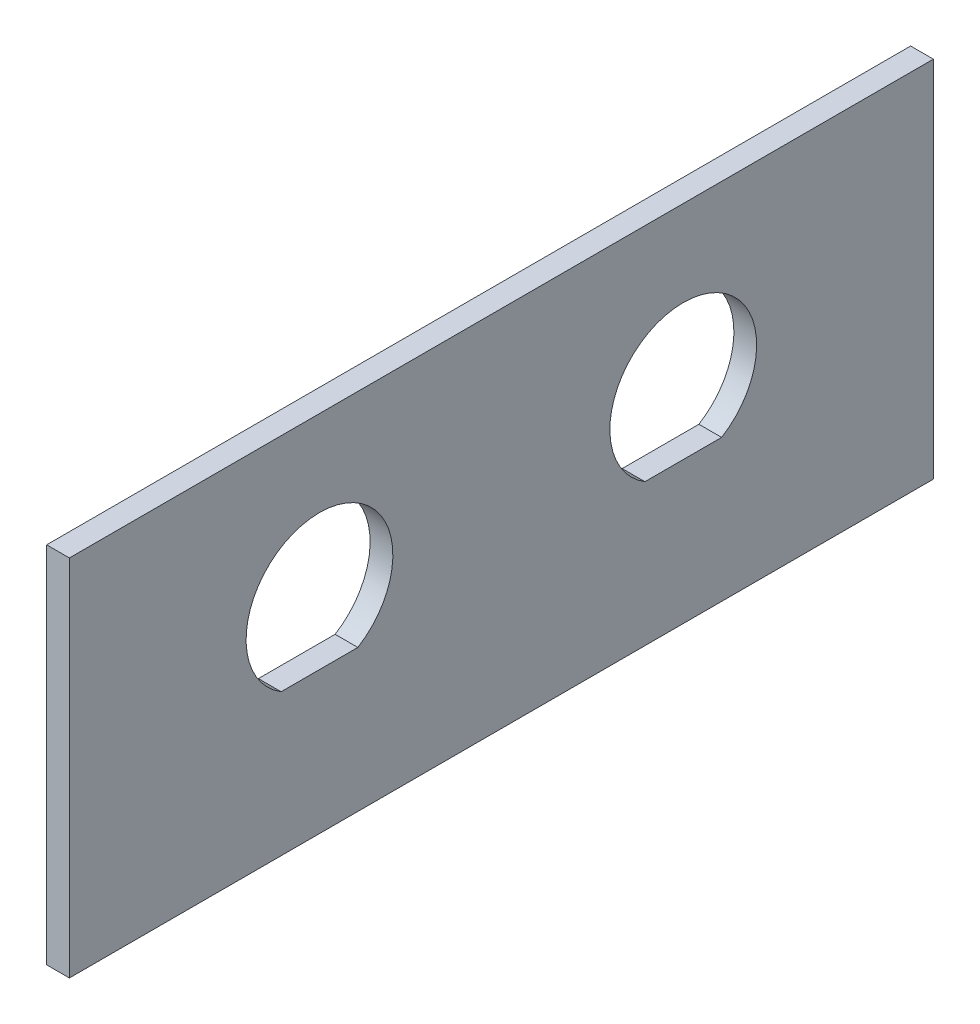
ISO-10303-21;
HEADER;
FILE_DESCRIPTION(('STEP AP214'),'2;1');
FILE_NAME('part.step','',(''),(''),'','','');
FILE_SCHEMA(('AUTOMOTIVE_DESIGN { 1 0 10303 214 1 1 1 1 }'));
ENDSEC;
DATA;
#1=APPLICATION_CONTEXT('core data for automotive mechanical design processes');
#2=APPLICATION_PROTOCOL_DEFINITION('international standard','automotive_design',2000,#1);
#3=PRODUCT_CONTEXT('',#1,'mechanical');
#4=PRODUCT('Part','Part','',(#3));
#5=PRODUCT_RELATED_PRODUCT_CATEGORY('part','',(#4));
#6=PRODUCT_DEFINITION_FORMATION('','',#4);
#7=PRODUCT_DEFINITION_CONTEXT('part definition',#1,'design');
#8=PRODUCT_DEFINITION('design','',#6,#7);
#9=PRODUCT_DEFINITION_SHAPE('','',#8);
#10=(LENGTH_UNIT() NAMED_UNIT(*) SI_UNIT(.MILLI.,.METRE.));
#11=(NAMED_UNIT(*) PLANE_ANGLE_UNIT() SI_UNIT($,.RADIAN.));
#12=(NAMED_UNIT(*) SI_UNIT($,.STERADIAN.) SOLID_ANGLE_UNIT());
#13=UNCERTAINTY_MEASURE_WITH_UNIT(LENGTH_MEASURE(1.E-05),#10,'distance_accuracy_value','');
#14=(GEOMETRIC_REPRESENTATION_CONTEXT(3) GLOBAL_UNCERTAINTY_ASSIGNED_CONTEXT((#13)) GLOBAL_UNIT_ASSIGNED_CONTEXT((#10,
#11,#12)) REPRESENTATION_CONTEXT('',''));
#15=CARTESIAN_POINT('',(0.,0.,0.));
#16=DIRECTION('',(0.,0.,1.));
#17=DIRECTION('',(1.,0.,0.));
#18=AXIS2_PLACEMENT_3D('',#15,#16,#17);
#19=CARTESIAN_POINT('',(101.6,50.8,60.325));
#20=DIRECTION('',(0.,0.,-1.));
#21=DIRECTION('',(-1.,0.,0.));
#22=AXIS2_PLACEMENT_3D('',#19,#20,#21);
#23=PLANE('',#22);
#24=DIRECTION('',(1.,0.,0.));
#25=VECTOR('',#24,1.);
#26=CARTESIAN_POINT('',(101.6,50.8,60.325));
#27=LINE('',#26,#25);
#28=CARTESIAN_POINT('',(98.425,50.8,60.325));
#29=VERTEX_POINT('',#28);
#30=CARTESIAN_POINT('',(101.6,50.8,60.325));
#31=VERTEX_POINT('',#30);
#32=EDGE_CURVE('E120',#29,#31,#27,.T.);
#33=ORIENTED_EDGE('',*,*,#32,.F.);
#34=DIRECTION('',(0.,1.,0.));
#35=VECTOR('',#34,1.);
#36=CARTESIAN_POINT('',(98.425,0.,60.325));
#37=LINE('',#36,#35);
#38=CARTESIAN_POINT('',(98.425,0.,60.325));
#39=VERTEX_POINT('',#38);
#40=EDGE_CURVE('E115',#39,#29,#37,.T.);
#41=ORIENTED_EDGE('',*,*,#40,.F.);
#42=DIRECTION('',(1.,0.,0.));
#43=VECTOR('',#42,1.);
#44=CARTESIAN_POINT('',(101.6,0.,60.325));
#45=LINE('',#44,#43);
#46=CARTESIAN_POINT('',(101.6,0.,60.325));
#47=VERTEX_POINT('',#46);
#48=EDGE_CURVE('E103',#39,#47,#45,.T.);
#49=ORIENTED_EDGE('',*,*,#48,.T.);
#50=DIRECTION('',(0.,-1.,0.));
#51=VECTOR('',#50,1.);
#52=CARTESIAN_POINT('',(101.6,50.8,60.325));
#53=LINE('',#52,#51);
#54=EDGE_CURVE('E11',#31,#47,#53,.T.);
#55=ORIENTED_EDGE('',*,*,#54,.F.);
#56=EDGE_LOOP('',(#33,#41,#49,#55));
#57=FACE_BOUND('',#56,.T.);
#58=ADVANCED_FACE('F34',(#57),#23,.F.);
#59=CARTESIAN_POINT('',(101.6,50.8,60.325));
#60=DIRECTION('',(-1.,0.,0.));
#61=DIRECTION('',(0.,0.,1.));
#62=AXIS2_PLACEMENT_3D('',#59,#60,#61);
#63=PLANE('',#62);
#64=DIRECTION('',(0.,0.,-1.));
#65=VECTOR('',#64,1.);
#66=CARTESIAN_POINT('',(101.6,19.8374,0.));
#67=LINE('',#66,#65);
#68=CARTESIAN_POINT('',(101.6,19.8374,-20.0432941605871));
#69=VERTEX_POINT('',#68);
#70=CARTESIAN_POINT('',(101.6,19.8374,-30.7567058394129));
#71=VERTEX_POINT('',#70);
#72=EDGE_CURVE('E144',#69,#71,#67,.T.);
#73=ORIENTED_EDGE('',*,*,#72,.F.);
#74=CARTESIAN_POINT('',(101.6,28.575,-25.4));
#75=DIRECTION('',(1.,0.,0.));
#76=DIRECTION('',(0.,0.,-1.));
#77=AXIS2_PLACEMENT_3D('',#74,#75,#76);
#78=CIRCLE('',#77,10.2489);
#79=EDGE_CURVE('E48',#71,#69,#78,.T.);
#80=ORIENTED_EDGE('',*,*,#79,.F.);
#81=EDGE_LOOP('',(#73,#80));
#82=FACE_BOUND('',#81,.T.);
#83=DIRECTION('',(0.,0.,-1.));
#84=VECTOR('',#83,1.);
#85=CARTESIAN_POINT('',(101.6,19.8374,0.));
#86=LINE('',#85,#84);
#87=CARTESIAN_POINT('',(101.6,19.8374,30.7567058394129));
#88=VERTEX_POINT('',#87);
#89=CARTESIAN_POINT('',(101.6,19.8374,20.0432941605871));
#90=VERTEX_POINT('',#89);
#91=EDGE_CURVE('E158',#88,#90,#86,.T.);
#92=ORIENTED_EDGE('',*,*,#91,.F.);
#93=CARTESIAN_POINT('',(101.6,28.575,25.4));
#94=DIRECTION('',(1.,0.,0.));
#95=DIRECTION('',(0.,0.,-1.));
#96=AXIS2_PLACEMENT_3D('',#93,#94,#95);
#97=CIRCLE('',#96,10.2489);
#98=EDGE_CURVE('E156',#90,#88,#97,.T.);
#99=ORIENTED_EDGE('',*,*,#98,.F.);
#100=EDGE_LOOP('',(#92,#99));
#101=FACE_BOUND('',#100,.T.);
#102=ORIENTED_EDGE('',*,*,#54,.T.);
#103=DIRECTION('',(0.,0.,-1.));
#104=VECTOR('',#103,1.);
#105=CARTESIAN_POINT('',(101.6,0.,60.325));
#106=LINE('',#105,#104);
#107=CARTESIAN_POINT('',(101.6,0.,-60.325));
#108=VERTEX_POINT('',#107);
#109=EDGE_CURVE('E121',#47,#108,#106,.T.);
#110=ORIENTED_EDGE('',*,*,#109,.T.);
#111=DIRECTION('',(0.,-1.,0.));
#112=VECTOR('',#111,1.);
#113=CARTESIAN_POINT('',(101.6,50.8,-60.325));
#114=LINE('',#113,#112);
#115=CARTESIAN_POINT('',(101.6,50.8,-60.325));
#116=VERTEX_POINT('',#115);
#117=EDGE_CURVE('E41',#116,#108,#114,.T.);
#118=ORIENTED_EDGE('',*,*,#117,.F.);
#119=DIRECTION('',(0.,0.,-1.));
#120=VECTOR('',#119,1.);
#121=CARTESIAN_POINT('',(101.6,50.8,60.325));
#122=LINE('',#121,#120);
#123=EDGE_CURVE('E123',#31,#116,#122,.T.);
#124=ORIENTED_EDGE('',*,*,#123,.F.);
#125=EDGE_LOOP('',(#102,#110,#118,#124));
#126=FACE_BOUND('',#125,.T.);
#127=ADVANCED_FACE('F136',(#82,#101,#126),#63,.F.);
#128=CARTESIAN_POINT('',(101.6,50.8,-60.325));
#129=DIRECTION('',(0.,0.,1.));
#130=DIRECTION('',(1.,0.,0.));
#131=AXIS2_PLACEMENT_3D('',#128,#129,#130);
#132=PLANE('',#131);
#133=DIRECTION('',(-1.,0.,0.));
#134=VECTOR('',#133,1.);
#135=CARTESIAN_POINT('',(101.6,0.,-60.325));
#136=LINE('',#135,#134);
#137=CARTESIAN_POINT('',(98.425,0.,-60.325));
#138=VERTEX_POINT('',#137);
#139=EDGE_CURVE('E102',#108,#138,#136,.T.);
#140=ORIENTED_EDGE('',*,*,#139,.T.);
#141=DIRECTION('',(0.,1.,0.));
#142=VECTOR('',#141,1.);
#143=CARTESIAN_POINT('',(98.425,0.,-60.325));
#144=LINE('',#143,#142);
#145=CARTESIAN_POINT('',(98.425,50.8,-60.325));
#146=VERTEX_POINT('',#145);
#147=EDGE_CURVE('E110',#138,#146,#144,.T.);
#148=ORIENTED_EDGE('',*,*,#147,.T.);
#149=DIRECTION('',(-1.,0.,0.));
#150=VECTOR('',#149,1.);
#151=CARTESIAN_POINT('',(101.6,50.8,-60.325));
#152=LINE('',#151,#150);
#153=EDGE_CURVE('E127',#116,#146,#152,.T.);
#154=ORIENTED_EDGE('',*,*,#153,.F.);
#155=ORIENTED_EDGE('',*,*,#117,.T.);
#156=EDGE_LOOP('',(#140,#148,#154,#155));
#157=FACE_BOUND('',#156,.T.);
#158=ADVANCED_FACE('F117',(#157),#132,.F.);
#159=CARTESIAN_POINT('',(0.,50.8,0.));
#160=DIRECTION('',(0.,1.,0.));
#161=DIRECTION('',(0.,0.,1.));
#162=AXIS2_PLACEMENT_3D('',#159,#160,#161);
#163=PLANE('',#162);
#164=DIRECTION('',(0.,0.,-1.));
#165=VECTOR('',#164,1.);
#166=CARTESIAN_POINT('',(98.425,50.8,57.15));
#167=LINE('',#166,#165);
#168=EDGE_CURVE('E107',#29,#146,#167,.T.);
#169=ORIENTED_EDGE('',*,*,#168,.F.);
#170=ORIENTED_EDGE('',*,*,#32,.T.);
#171=ORIENTED_EDGE('',*,*,#123,.T.);
#172=ORIENTED_EDGE('',*,*,#153,.T.);
#173=EDGE_LOOP('',(#169,#170,#171,#172));
#174=FACE_BOUND('',#173,.T.);
#175=ADVANCED_FACE('F137',(#174),#163,.T.);
#176=CARTESIAN_POINT('',(0.,0.,0.));
#177=DIRECTION('',(0.,1.,0.));
#178=DIRECTION('',(0.,0.,1.));
#179=AXIS2_PLACEMENT_3D('',#176,#177,#178);
#180=PLANE('',#179);
#181=ORIENTED_EDGE('',*,*,#48,.F.);
#182=DIRECTION('',(0.,0.,-1.));
#183=VECTOR('',#182,1.);
#184=CARTESIAN_POINT('',(98.425,0.,57.15));
#185=LINE('',#184,#183);
#186=EDGE_CURVE('E97',#39,#138,#185,.T.);
#187=ORIENTED_EDGE('',*,*,#186,.T.);
#188=ORIENTED_EDGE('',*,*,#139,.F.);
#189=ORIENTED_EDGE('',*,*,#109,.F.);
#190=EDGE_LOOP('',(#181,#187,#188,#189));
#191=FACE_BOUND('',#190,.T.);
#192=ADVANCED_FACE('F99',(#191),#180,.F.);
#193=CARTESIAN_POINT('',(98.425,0.,57.15));
#194=DIRECTION('',(1.,0.,0.));
#195=DIRECTION('',(0.,0.,-1.));
#196=AXIS2_PLACEMENT_3D('',#193,#194,#195);
#197=PLANE('',#196);
#198=DIRECTION('',(0.,0.,1.));
#199=VECTOR('',#198,1.);
#200=CARTESIAN_POINT('',(98.425,19.8374,0.));
#201=LINE('',#200,#199);
#202=CARTESIAN_POINT('',(98.425,19.8374,-30.7567058394129));
#203=VERTEX_POINT('',#202);
#204=CARTESIAN_POINT('',(98.425,19.8374,-20.0432941605871));
#205=VERTEX_POINT('',#204);
#206=EDGE_CURVE('E150',#203,#205,#201,.T.);
#207=ORIENTED_EDGE('',*,*,#206,.F.);
#208=CARTESIAN_POINT('',(98.425,28.575,-25.4));
#209=DIRECTION('',(1.,0.,0.));
#210=DIRECTION('',(0.,0.,-1.));
#211=AXIS2_PLACEMENT_3D('',#208,#209,#210);
#212=CIRCLE('',#211,10.2489);
#213=EDGE_CURVE('E53',#205,#203,#212,.F.);
#214=ORIENTED_EDGE('',*,*,#213,.F.);
#215=EDGE_LOOP('',(#207,#214));
#216=FACE_BOUND('',#215,.T.);
#217=DIRECTION('',(0.,0.,1.));
#218=VECTOR('',#217,1.);
#219=CARTESIAN_POINT('',(98.425,19.8374,0.));
#220=LINE('',#219,#218);
#221=CARTESIAN_POINT('',(98.425,19.8374,20.0432941605871));
#222=VERTEX_POINT('',#221);
#223=CARTESIAN_POINT('',(98.425,19.8374,30.7567058394129));
#224=VERTEX_POINT('',#223);
#225=EDGE_CURVE('E138',#222,#224,#220,.T.);
#226=ORIENTED_EDGE('',*,*,#225,.F.);
#227=CARTESIAN_POINT('',(98.425,28.575,25.4));
#228=DIRECTION('',(1.,0.,0.));
#229=DIRECTION('',(0.,0.,-1.));
#230=AXIS2_PLACEMENT_3D('',#227,#228,#229);
#231=CIRCLE('',#230,10.2489);
#232=EDGE_CURVE('E154',#224,#222,#231,.F.);
#233=ORIENTED_EDGE('',*,*,#232,.F.);
#234=EDGE_LOOP('',(#226,#233));
#235=FACE_BOUND('',#234,.T.);
#236=ORIENTED_EDGE('',*,*,#168,.T.);
#237=ORIENTED_EDGE('',*,*,#147,.F.);
#238=ORIENTED_EDGE('',*,*,#186,.F.);
#239=ORIENTED_EDGE('',*,*,#40,.T.);
#240=EDGE_LOOP('',(#236,#237,#238,#239));
#241=FACE_BOUND('',#240,.T.);
#242=ADVANCED_FACE('F111',(#216,#235,#241),#197,.F.);
#243=CARTESIAN_POINT('',(-101.601,28.575,25.4));
#244=DIRECTION('',(1.,0.,0.));
#245=DIRECTION('',(0.,0.,-1.));
#246=AXIS2_PLACEMENT_3D('',#243,#244,#245);
#247=CYLINDRICAL_SURFACE('',#246,10.2489);
#248=ORIENTED_EDGE('',*,*,#232,.T.);
#249=DIRECTION('',(1.,0.,0.));
#250=VECTOR('',#249,1.);
#251=CARTESIAN_POINT('',(-101.601,19.8374,20.0432941605871));
#252=LINE('',#251,#250);
#253=EDGE_CURVE('E162',#222,#90,#252,.T.);
#254=ORIENTED_EDGE('',*,*,#253,.T.);
#255=ORIENTED_EDGE('',*,*,#98,.T.);
#256=DIRECTION('',(1.,0.,0.));
#257=VECTOR('',#256,1.);
#258=CARTESIAN_POINT('',(-101.601,19.8374,30.7567058394129));
#259=LINE('',#258,#257);
#260=EDGE_CURVE('E161',#224,#88,#259,.T.);
#261=ORIENTED_EDGE('',*,*,#260,.F.);
#262=EDGE_LOOP('',(#248,#254,#255,#261));
#263=FACE_BOUND('',#262,.T.);
#264=ADVANCED_FACE('F175',(#263),#247,.F.);
#265=CARTESIAN_POINT('',(-101.601,19.8374,0.));
#266=DIRECTION('',(0.,-1.,0.));
#267=DIRECTION('',(0.,0.,-1.));
#268=AXIS2_PLACEMENT_3D('',#265,#266,#267);
#269=PLANE('',#268);
#270=ORIENTED_EDGE('',*,*,#225,.T.);
#271=ORIENTED_EDGE('',*,*,#260,.T.);
#272=ORIENTED_EDGE('',*,*,#91,.T.);
#273=ORIENTED_EDGE('',*,*,#253,.F.);
#274=EDGE_LOOP('',(#270,#271,#272,#273));
#275=FACE_BOUND('',#274,.T.);
#276=ADVANCED_FACE('F171',(#275),#269,.F.);
#277=CARTESIAN_POINT('',(-101.601,28.575,-25.4));
#278=DIRECTION('',(1.,0.,0.));
#279=DIRECTION('',(0.,0.,-1.));
#280=AXIS2_PLACEMENT_3D('',#277,#278,#279);
#281=CYLINDRICAL_SURFACE('',#280,10.2489);
#282=ORIENTED_EDGE('',*,*,#213,.T.);
#283=DIRECTION('',(1.,0.,0.));
#284=VECTOR('',#283,1.);
#285=CARTESIAN_POINT('',(-101.601,19.8374,-30.7567058394129));
#286=LINE('',#285,#284);
#287=EDGE_CURVE('E148',#203,#71,#286,.T.);
#288=ORIENTED_EDGE('',*,*,#287,.T.);
#289=ORIENTED_EDGE('',*,*,#79,.T.);
#290=DIRECTION('',(1.,0.,0.));
#291=VECTOR('',#290,1.);
#292=CARTESIAN_POINT('',(-101.601,19.8374,-20.0432941605871));
#293=LINE('',#292,#291);
#294=EDGE_CURVE('E147',#205,#69,#293,.T.);
#295=ORIENTED_EDGE('',*,*,#294,.F.);
#296=EDGE_LOOP('',(#282,#288,#289,#295));
#297=FACE_BOUND('',#296,.T.);
#298=ADVANCED_FACE('F198',(#297),#281,.F.);
#299=CARTESIAN_POINT('',(-101.601,19.8374,0.));
#300=DIRECTION('',(0.,-1.,0.));
#301=DIRECTION('',(0.,0.,-1.));
#302=AXIS2_PLACEMENT_3D('',#299,#300,#301);
#303=PLANE('',#302);
#304=ORIENTED_EDGE('',*,*,#206,.T.);
#305=ORIENTED_EDGE('',*,*,#294,.T.);
#306=ORIENTED_EDGE('',*,*,#72,.T.);
#307=ORIENTED_EDGE('',*,*,#287,.F.);
#308=EDGE_LOOP('',(#304,#305,#306,#307));
#309=FACE_BOUND('',#308,.T.);
#310=ADVANCED_FACE('F201',(#309),#303,.F.);
#311=CLOSED_SHELL('',(#58,#127,#158,#175,#192,#242,#264,#276,#298,#310));
#312=MANIFOLD_SOLID_BREP('B2',#311);
#313=ADVANCED_BREP_SHAPE_REPRESENTATION('',(#18,#312),#14);
#314=SHAPE_DEFINITION_REPRESENTATION(#9,#313);
ENDSEC;
END-ISO-10303-21;
